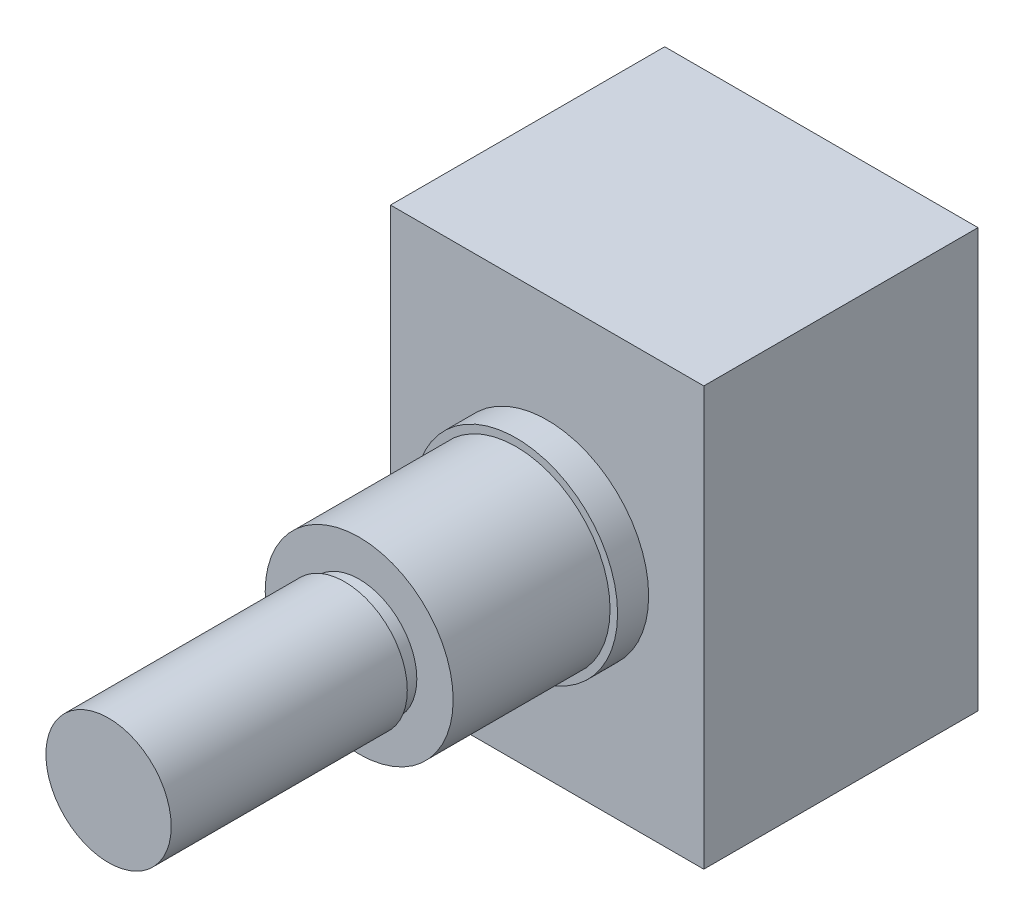
ISO-10303-21;
HEADER;
FILE_DESCRIPTION(('STEP AP214'),'2;1');
FILE_NAME('part.step','',(''),(''),'','','');
FILE_SCHEMA(('AUTOMOTIVE_DESIGN { 1 0 10303 214 1 1 1 1 }'));
ENDSEC;
DATA;
#1=APPLICATION_CONTEXT('core data for automotive mechanical design processes');
#2=APPLICATION_PROTOCOL_DEFINITION('international standard','automotive_design',2000,#1);
#3=PRODUCT_CONTEXT('',#1,'mechanical');
#4=PRODUCT('Part','Part','',(#3));
#5=PRODUCT_RELATED_PRODUCT_CATEGORY('part','',(#4));
#6=PRODUCT_DEFINITION_FORMATION('','',#4);
#7=PRODUCT_DEFINITION_CONTEXT('part definition',#1,'design');
#8=PRODUCT_DEFINITION('design','',#6,#7);
#9=PRODUCT_DEFINITION_SHAPE('','',#8);
#10=(LENGTH_UNIT() NAMED_UNIT(*) SI_UNIT(.MILLI.,.METRE.));
#11=(NAMED_UNIT(*) PLANE_ANGLE_UNIT() SI_UNIT($,.RADIAN.));
#12=(NAMED_UNIT(*) SI_UNIT($,.STERADIAN.) SOLID_ANGLE_UNIT());
#13=UNCERTAINTY_MEASURE_WITH_UNIT(LENGTH_MEASURE(1.E-05),#10,'distance_accuracy_value','');
#14=(GEOMETRIC_REPRESENTATION_CONTEXT(3) GLOBAL_UNCERTAINTY_ASSIGNED_CONTEXT((#13)) GLOBAL_UNIT_ASSIGNED_CONTEXT((#10,
#11,#12)) REPRESENTATION_CONTEXT('',''));
#15=CARTESIAN_POINT('',(0.,0.,0.));
#16=DIRECTION('',(0.,0.,1.));
#17=DIRECTION('',(1.,0.,0.));
#18=AXIS2_PLACEMENT_3D('',#15,#16,#17);
#19=CARTESIAN_POINT('',(0.,0.,23.4188));
#20=DIRECTION('',(0.,0.,1.));
#21=DIRECTION('',(1.,0.,0.));
#22=AXIS2_PLACEMENT_3D('',#19,#20,#21);
#23=PLANE('',#22);
#24=CARTESIAN_POINT('',(0.,0.,23.4188));
#25=DIRECTION('',(0.,0.,1.));
#26=DIRECTION('',(1.,0.,0.));
#27=AXIS2_PLACEMENT_3D('',#24,#25,#26);
#28=CIRCLE('',#27,4.7625);
#29=CARTESIAN_POINT('',(4.7625,0.,23.4188));
#30=VERTEX_POINT('',#29);
#31=EDGE_CURVE('E260',#30,#30,#28,.T.);
#32=ORIENTED_EDGE('',*,*,#31,.T.);
#33=EDGE_LOOP('',(#32));
#34=FACE_BOUND('',#33,.T.);
#35=CARTESIAN_POINT('',(0.,0.,23.4188));
#36=DIRECTION('',(0.,0.,1.));
#37=DIRECTION('',(1.,0.,0.));
#38=AXIS2_PLACEMENT_3D('',#35,#36,#37);
#39=CIRCLE('',#38,2.921);
#40=CARTESIAN_POINT('',(2.921,0.,23.4188));
#41=VERTEX_POINT('',#40);
#42=EDGE_CURVE('E278',#41,#41,#39,.T.);
#43=ORIENTED_EDGE('',*,*,#42,.F.);
#44=EDGE_LOOP('',(#43));
#45=FACE_BOUND('',#44,.T.);
#46=ADVANCED_FACE('F35',(#34,#45),#23,.T.);
#47=CARTESIAN_POINT('',(0.,0.,15.4686));
#48=DIRECTION('',(0.,0.,1.));
#49=DIRECTION('',(1.,0.,0.));
#50=AXIS2_PLACEMENT_3D('',#47,#48,#49);
#51=PLANE('',#50);
#52=CARTESIAN_POINT('',(0.,0.,15.4686));
#53=DIRECTION('',(0.,0.,1.));
#54=DIRECTION('',(1.,0.,0.));
#55=AXIS2_PLACEMENT_3D('',#52,#53,#54);
#56=CIRCLE('',#55,5.1435);
#57=CARTESIAN_POINT('',(5.1435,0.,15.4686));
#58=VERTEX_POINT('',#57);
#59=EDGE_CURVE('E107',#58,#58,#56,.T.);
#60=ORIENTED_EDGE('',*,*,#59,.T.);
#61=EDGE_LOOP('',(#60));
#62=FACE_BOUND('',#61,.T.);
#63=CARTESIAN_POINT('',(0.,0.,15.4686));
#64=DIRECTION('',(0.,0.,1.));
#65=DIRECTION('',(1.,0.,0.));
#66=AXIS2_PLACEMENT_3D('',#63,#64,#65);
#67=CIRCLE('',#66,4.7625);
#68=CARTESIAN_POINT('',(4.7625,0.,15.4686));
#69=VERTEX_POINT('',#68);
#70=EDGE_CURVE('E39',#69,#69,#67,.F.);
#71=ORIENTED_EDGE('',*,*,#70,.T.);
#72=EDGE_LOOP('',(#71));
#73=FACE_BOUND('',#72,.T.);
#74=ADVANCED_FACE('F131',(#62,#73),#51,.T.);
#75=CARTESIAN_POINT('',(0.,0.,13.8938));
#76=DIRECTION('',(0.,0.,-1.));
#77=DIRECTION('',(-1.,0.,0.));
#78=AXIS2_PLACEMENT_3D('',#75,#76,#77);
#79=PLANE('',#78);
#80=DIRECTION('',(0.,1.,0.));
#81=VECTOR('',#80,1.);
#82=CARTESIAN_POINT('',(7.9375,-10.6045,13.8938));
#83=LINE('',#82,#81);
#84=CARTESIAN_POINT('',(7.9375,-10.6045,13.8938));
#85=VERTEX_POINT('',#84);
#86=CARTESIAN_POINT('',(7.9375,10.6045,13.8938));
#87=VERTEX_POINT('',#86);
#88=EDGE_CURVE('E90',#85,#87,#83,.T.);
#89=ORIENTED_EDGE('',*,*,#88,.T.);
#90=DIRECTION('',(-1.,0.,0.));
#91=VECTOR('',#90,1.);
#92=CARTESIAN_POINT('',(-7.9375,10.6045,13.8938));
#93=LINE('',#92,#91);
#94=CARTESIAN_POINT('',(-7.9375,10.6045,13.8938));
#95=VERTEX_POINT('',#94);
#96=EDGE_CURVE('E84',#87,#95,#93,.T.);
#97=ORIENTED_EDGE('',*,*,#96,.T.);
#98=DIRECTION('',(0.,-1.,0.));
#99=VECTOR('',#98,1.);
#100=CARTESIAN_POINT('',(-7.9375,-10.6045,13.8938));
#101=LINE('',#100,#99);
#102=CARTESIAN_POINT('',(-7.9375,-10.6045,13.8938));
#103=VERTEX_POINT('',#102);
#104=EDGE_CURVE('E88',#95,#103,#101,.T.);
#105=ORIENTED_EDGE('',*,*,#104,.T.);
#106=DIRECTION('',(1.,0.,0.));
#107=VECTOR('',#106,1.);
#108=CARTESIAN_POINT('',(-7.9375,-10.6045,13.8938));
#109=LINE('',#108,#107);
#110=EDGE_CURVE('E53',#103,#85,#109,.T.);
#111=ORIENTED_EDGE('',*,*,#110,.T.);
#112=EDGE_LOOP('',(#89,#97,#105,#111));
#113=FACE_BOUND('',#112,.T.);
#114=CARTESIAN_POINT('',(0.,0.,13.8938));
#115=DIRECTION('',(0.,0.,-1.));
#116=DIRECTION('',(-1.,0.,0.));
#117=AXIS2_PLACEMENT_3D('',#114,#115,#116);
#118=CIRCLE('',#117,5.1435);
#119=CARTESIAN_POINT('',(-5.1435,0.,13.8938));
#120=VERTEX_POINT('',#119);
#121=EDGE_CURVE('E11',#120,#120,#118,.F.);
#122=ORIENTED_EDGE('',*,*,#121,.F.);
#123=EDGE_LOOP('',(#122));
#124=FACE_BOUND('',#123,.T.);
#125=ADVANCED_FACE('F85',(#113,#124),#79,.F.);
#126=CARTESIAN_POINT('',(7.9375,-10.6045,13.8938));
#127=DIRECTION('',(-1.,0.,0.));
#128=DIRECTION('',(0.,0.,1.));
#129=AXIS2_PLACEMENT_3D('',#126,#127,#128);
#130=PLANE('',#129);
#131=DIRECTION('',(0.,1.,0.));
#132=VECTOR('',#131,1.);
#133=CARTESIAN_POINT('',(7.9375,-10.6045,0.));
#134=LINE('',#133,#132);
#135=CARTESIAN_POINT('',(7.9375,-10.6045,0.));
#136=VERTEX_POINT('',#135);
#137=CARTESIAN_POINT('',(7.9375,10.6045,0.));
#138=VERTEX_POINT('',#137);
#139=EDGE_CURVE('E104',#136,#138,#134,.T.);
#140=ORIENTED_EDGE('',*,*,#139,.T.);
#141=DIRECTION('',(0.,0.,-1.));
#142=VECTOR('',#141,1.);
#143=CARTESIAN_POINT('',(7.9375,10.6045,13.8938));
#144=LINE('',#143,#142);
#145=EDGE_CURVE('E45',#87,#138,#144,.T.);
#146=ORIENTED_EDGE('',*,*,#145,.F.);
#147=ORIENTED_EDGE('',*,*,#88,.F.);
#148=DIRECTION('',(0.,0.,-1.));
#149=VECTOR('',#148,1.);
#150=CARTESIAN_POINT('',(7.9375,-10.6045,13.8938));
#151=LINE('',#150,#149);
#152=EDGE_CURVE('E100',#85,#136,#151,.T.);
#153=ORIENTED_EDGE('',*,*,#152,.T.);
#154=EDGE_LOOP('',(#140,#146,#147,#153));
#155=FACE_BOUND('',#154,.T.);
#156=ADVANCED_FACE('F37',(#155),#130,.F.);
#157=CARTESIAN_POINT('',(-7.9375,10.6045,13.8938));
#158=DIRECTION('',(0.,-1.,0.));
#159=DIRECTION('',(0.,0.,-1.));
#160=AXIS2_PLACEMENT_3D('',#157,#158,#159);
#161=PLANE('',#160);
#162=DIRECTION('',(-1.,0.,0.));
#163=VECTOR('',#162,1.);
#164=CARTESIAN_POINT('',(-7.9375,10.6045,0.));
#165=LINE('',#164,#163);
#166=CARTESIAN_POINT('',(-7.9375,10.6045,0.));
#167=VERTEX_POINT('',#166);
#168=EDGE_CURVE('E95',#138,#167,#165,.T.);
#169=ORIENTED_EDGE('',*,*,#168,.T.);
#170=DIRECTION('',(0.,0.,-1.));
#171=VECTOR('',#170,1.);
#172=CARTESIAN_POINT('',(-7.9375,10.6045,13.8938));
#173=LINE('',#172,#171);
#174=EDGE_CURVE('E93',#95,#167,#173,.T.);
#175=ORIENTED_EDGE('',*,*,#174,.F.);
#176=ORIENTED_EDGE('',*,*,#96,.F.);
#177=ORIENTED_EDGE('',*,*,#145,.T.);
#178=EDGE_LOOP('',(#169,#175,#176,#177));
#179=FACE_BOUND('',#178,.T.);
#180=ADVANCED_FACE('F94',(#179),#161,.F.);
#181=CARTESIAN_POINT('',(-7.9375,-10.6045,13.8938));
#182=DIRECTION('',(1.,0.,0.));
#183=DIRECTION('',(0.,0.,-1.));
#184=AXIS2_PLACEMENT_3D('',#181,#182,#183);
#185=PLANE('',#184);
#186=DIRECTION('',(0.,-1.,0.));
#187=VECTOR('',#186,1.);
#188=CARTESIAN_POINT('',(-7.9375,-10.6045,0.));
#189=LINE('',#188,#187);
#190=CARTESIAN_POINT('',(-7.9375,-10.6045,0.));
#191=VERTEX_POINT('',#190);
#192=EDGE_CURVE('E70',#167,#191,#189,.T.);
#193=ORIENTED_EDGE('',*,*,#192,.T.);
#194=DIRECTION('',(0.,0.,-1.));
#195=VECTOR('',#194,1.);
#196=CARTESIAN_POINT('',(-7.9375,-10.6045,13.8938));
#197=LINE('',#196,#195);
#198=EDGE_CURVE('E96',#103,#191,#197,.T.);
#199=ORIENTED_EDGE('',*,*,#198,.F.);
#200=ORIENTED_EDGE('',*,*,#104,.F.);
#201=ORIENTED_EDGE('',*,*,#174,.T.);
#202=EDGE_LOOP('',(#193,#199,#200,#201));
#203=FACE_BOUND('',#202,.T.);
#204=ADVANCED_FACE('F98',(#203),#185,.F.);
#205=CARTESIAN_POINT('',(-7.9375,-10.6045,13.8938));
#206=DIRECTION('',(0.,1.,0.));
#207=DIRECTION('',(0.,0.,1.));
#208=AXIS2_PLACEMENT_3D('',#205,#206,#207);
#209=PLANE('',#208);
#210=DIRECTION('',(1.,0.,0.));
#211=VECTOR('',#210,1.);
#212=CARTESIAN_POINT('',(-7.9375,-10.6045,0.));
#213=LINE('',#212,#211);
#214=EDGE_CURVE('E76',#191,#136,#213,.T.);
#215=ORIENTED_EDGE('',*,*,#214,.T.);
#216=ORIENTED_EDGE('',*,*,#152,.F.);
#217=ORIENTED_EDGE('',*,*,#110,.F.);
#218=ORIENTED_EDGE('',*,*,#198,.T.);
#219=EDGE_LOOP('',(#215,#216,#217,#218));
#220=FACE_BOUND('',#219,.T.);
#221=ADVANCED_FACE('F119',(#220),#209,.F.);
#222=CARTESIAN_POINT('',(0.,0.,0.));
#223=DIRECTION('',(0.,0.,-1.));
#224=DIRECTION('',(-1.,0.,0.));
#225=AXIS2_PLACEMENT_3D('',#222,#223,#224);
#226=PLANE('',#225);
#227=ORIENTED_EDGE('',*,*,#139,.F.);
#228=ORIENTED_EDGE('',*,*,#214,.F.);
#229=ORIENTED_EDGE('',*,*,#192,.F.);
#230=ORIENTED_EDGE('',*,*,#168,.F.);
#231=EDGE_LOOP('',(#227,#228,#229,#230));
#232=FACE_BOUND('',#231,.T.);
#233=ADVANCED_FACE('F116',(#232),#226,.T.);
#234=CARTESIAN_POINT('',(0.,0.,15.4686));
#235=DIRECTION('',(0.,0.,-1.));
#236=DIRECTION('',(-1.,0.,0.));
#237=AXIS2_PLACEMENT_3D('',#234,#235,#236);
#238=CYLINDRICAL_SURFACE('',#237,5.1435);
#239=ORIENTED_EDGE('',*,*,#59,.F.);
#240=EDGE_LOOP('',(#239));
#241=FACE_BOUND('',#240,.T.);
#242=ORIENTED_EDGE('',*,*,#121,.T.);
#243=EDGE_LOOP('',(#242));
#244=FACE_BOUND('',#243,.T.);
#245=ADVANCED_FACE('F118',(#241,#244),#238,.T.);
#246=CARTESIAN_POINT('',(0.,0.,23.4188));
#247=DIRECTION('',(0.,0.,-1.));
#248=DIRECTION('',(-1.,0.,0.));
#249=AXIS2_PLACEMENT_3D('',#246,#247,#248);
#250=CYLINDRICAL_SURFACE('',#249,4.7625);
#251=ORIENTED_EDGE('',*,*,#70,.F.);
#252=EDGE_LOOP('',(#251));
#253=FACE_BOUND('',#252,.T.);
#254=ORIENTED_EDGE('',*,*,#31,.F.);
#255=EDGE_LOOP('',(#254));
#256=FACE_BOUND('',#255,.T.);
#257=ADVANCED_FACE('F125',(#253,#256),#250,.T.);
#258=CARTESIAN_POINT('',(3.175,0.,24.1554));
#259=DIRECTION('',(0.,0.,1.));
#260=DIRECTION('',(1.,0.,0.));
#261=AXIS2_PLACEMENT_3D('',#258,#259,#260);
#262=PLANE('',#261);
#263=CARTESIAN_POINT('',(0.,0.,24.1554));
#264=DIRECTION('',(0.,0.,1.));
#265=DIRECTION('',(1.,0.,0.));
#266=AXIS2_PLACEMENT_3D('',#263,#264,#265);
#267=CIRCLE('',#266,3.175);
#268=CARTESIAN_POINT('',(3.175,0.,24.1554));
#269=VERTEX_POINT('',#268);
#270=EDGE_CURVE('E256',#269,#269,#267,.T.);
#271=ORIENTED_EDGE('',*,*,#270,.F.);
#272=EDGE_LOOP('',(#271));
#273=FACE_BOUND('',#272,.T.);
#274=CARTESIAN_POINT('',(0.,0.,24.1554));
#275=DIRECTION('',(0.,0.,1.));
#276=DIRECTION('',(1.,0.,0.));
#277=AXIS2_PLACEMENT_3D('',#274,#275,#276);
#278=CIRCLE('',#277,2.921);
#279=CARTESIAN_POINT('',(2.921,0.,24.1554));
#280=VERTEX_POINT('',#279);
#281=EDGE_CURVE('E263',#280,#280,#278,.T.);
#282=ORIENTED_EDGE('',*,*,#281,.T.);
#283=EDGE_LOOP('',(#282));
#284=FACE_BOUND('',#283,.T.);
#285=ADVANCED_FACE('F146',(#273,#284),#262,.F.);
#286=CARTESIAN_POINT('',(0.,0.,36.1188));
#287=DIRECTION('',(0.,0.,1.));
#288=DIRECTION('',(1.,0.,0.));
#289=AXIS2_PLACEMENT_3D('',#286,#287,#288);
#290=CYLINDRICAL_SURFACE('',#289,2.921);
#291=ORIENTED_EDGE('',*,*,#281,.F.);
#292=EDGE_LOOP('',(#291));
#293=FACE_BOUND('',#292,.T.);
#294=ORIENTED_EDGE('',*,*,#42,.T.);
#295=EDGE_LOOP('',(#294));
#296=FACE_BOUND('',#295,.T.);
#297=ADVANCED_FACE('F206',(#293,#296),#290,.T.);
#298=CARTESIAN_POINT('',(0.,0.,36.1188));
#299=DIRECTION('',(0.,0.,1.));
#300=DIRECTION('',(1.,0.,0.));
#301=AXIS2_PLACEMENT_3D('',#298,#299,#300);
#302=PLANE('',#301);
#303=CARTESIAN_POINT('',(0.,0.,36.1188));
#304=DIRECTION('',(0.,0.,1.));
#305=DIRECTION('',(1.,0.,0.));
#306=AXIS2_PLACEMENT_3D('',#303,#304,#305);
#307=CIRCLE('',#306,3.175);
#308=CARTESIAN_POINT('',(3.175,0.,36.1188));
#309=VERTEX_POINT('',#308);
#310=EDGE_CURVE('E259',#309,#309,#307,.T.);
#311=ORIENTED_EDGE('',*,*,#310,.T.);
#312=EDGE_LOOP('',(#311));
#313=FACE_BOUND('',#312,.T.);
#314=ADVANCED_FACE('F201',(#313),#302,.T.);
#315=CARTESIAN_POINT('',(0.,0.,36.1188));
#316=DIRECTION('',(0.,0.,-1.));
#317=DIRECTION('',(-1.,0.,0.));
#318=AXIS2_PLACEMENT_3D('',#315,#316,#317);
#319=CYLINDRICAL_SURFACE('',#318,3.175);
#320=ORIENTED_EDGE('',*,*,#270,.T.);
#321=EDGE_LOOP('',(#320));
#322=FACE_BOUND('',#321,.T.);
#323=ORIENTED_EDGE('',*,*,#310,.F.);
#324=EDGE_LOOP('',(#323));
#325=FACE_BOUND('',#324,.T.);
#326=ADVANCED_FACE('F143',(#322,#325),#319,.T.);
#327=CLOSED_SHELL('',(#46,#74,#125,#156,#180,#204,#221,#233,#245,#257,#285,#297,#314,#326));
#328=MANIFOLD_SOLID_BREP('B2',#327);
#329=ADVANCED_BREP_SHAPE_REPRESENTATION('',(#18,#328),#14);
#330=SHAPE_DEFINITION_REPRESENTATION(#9,#329);
ENDSEC;
END-ISO-10303-21;
